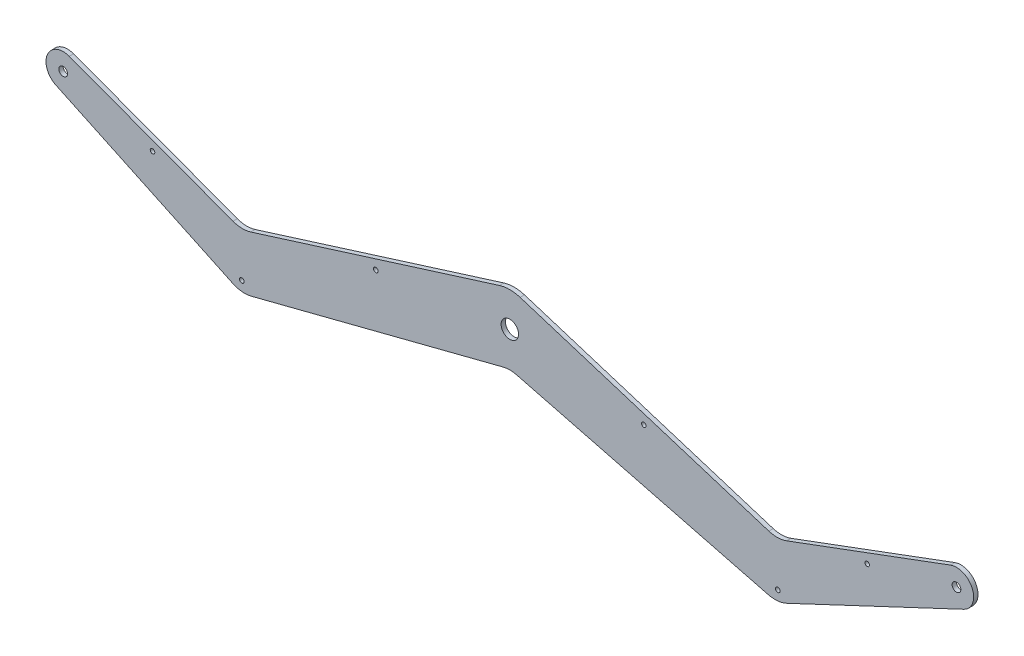
ISO-10303-21;
HEADER;
FILE_DESCRIPTION(('STEP AP214'),'2;1');
FILE_NAME('part.step','',(''),(''),'','','');
FILE_SCHEMA(('AUTOMOTIVE_DESIGN { 1 0 10303 214 1 1 1 1 }'));
ENDSEC;
DATA;
#1=APPLICATION_CONTEXT('core data for automotive mechanical design processes');
#2=APPLICATION_PROTOCOL_DEFINITION('international standard','automotive_design',2000,#1);
#3=PRODUCT_CONTEXT('',#1,'mechanical');
#4=PRODUCT('Part','Part','',(#3));
#5=PRODUCT_RELATED_PRODUCT_CATEGORY('part','',(#4));
#6=PRODUCT_DEFINITION_FORMATION('','',#4);
#7=PRODUCT_DEFINITION_CONTEXT('part definition',#1,'design');
#8=PRODUCT_DEFINITION('design','',#6,#7);
#9=PRODUCT_DEFINITION_SHAPE('','',#8);
#10=(LENGTH_UNIT() NAMED_UNIT(*) SI_UNIT(.MILLI.,.METRE.));
#11=(NAMED_UNIT(*) PLANE_ANGLE_UNIT() SI_UNIT($,.RADIAN.));
#12=(NAMED_UNIT(*) SI_UNIT($,.STERADIAN.) SOLID_ANGLE_UNIT());
#13=UNCERTAINTY_MEASURE_WITH_UNIT(LENGTH_MEASURE(1.E-05),#10,'distance_accuracy_value','');
#14=(GEOMETRIC_REPRESENTATION_CONTEXT(3) GLOBAL_UNCERTAINTY_ASSIGNED_CONTEXT((#13)) GLOBAL_UNIT_ASSIGNED_CONTEXT((#10,
#11,#12)) REPRESENTATION_CONTEXT('',''));
#15=CARTESIAN_POINT('',(0.,0.,0.));
#16=DIRECTION('',(0.,0.,1.));
#17=DIRECTION('',(1.,0.,0.));
#18=AXIS2_PLACEMENT_3D('',#15,#16,#17);
#19=CARTESIAN_POINT('',(0.,0.,3.18));
#20=DIRECTION('',(0.,0.,-1.));
#21=DIRECTION('',(-1.,0.,0.));
#22=AXIS2_PLACEMENT_3D('',#19,#20,#21);
#23=CYLINDRICAL_SURFACE('',#22,25.);
#24=CARTESIAN_POINT('',(0.,0.,0.));
#25=DIRECTION('',(0.,0.,1.));
#26=DIRECTION('',(1.,0.,0.));
#27=AXIS2_PLACEMENT_3D('',#24,#25,#26);
#28=CIRCLE('',#27,25.);
#29=CARTESIAN_POINT('',(7.48639197609011,23.8527552953602,0.));
#30=VERTEX_POINT('',#29);
#31=CARTESIAN_POINT('',(-7.48639197609028,23.8527552953601,0.));
#32=VERTEX_POINT('',#31);
#33=EDGE_CURVE('E194',#30,#32,#28,.T.);
#34=ORIENTED_EDGE('',*,*,#33,.T.);
#35=DIRECTION('',(0.,0.,-1.));
#36=VECTOR('',#35,1.);
#37=CARTESIAN_POINT('',(-7.48639197609028,23.8527552953601,3.18));
#38=LINE('',#37,#36);
#39=CARTESIAN_POINT('',(-7.48639197609028,23.8527552953601,3.18));
#40=VERTEX_POINT('',#39);
#41=EDGE_CURVE('E11',#40,#32,#38,.T.);
#42=ORIENTED_EDGE('',*,*,#41,.F.);
#43=CARTESIAN_POINT('',(0.,0.,3.18));
#44=DIRECTION('',(0.,0.,1.));
#45=DIRECTION('',(1.,0.,0.));
#46=AXIS2_PLACEMENT_3D('',#43,#44,#45);
#47=CIRCLE('',#46,25.);
#48=CARTESIAN_POINT('',(7.48639197609011,23.8527552953602,3.18));
#49=VERTEX_POINT('',#48);
#50=EDGE_CURVE('E241',#49,#40,#47,.T.);
#51=ORIENTED_EDGE('',*,*,#50,.F.);
#52=DIRECTION('',(0.,0.,-1.));
#53=VECTOR('',#52,1.);
#54=CARTESIAN_POINT('',(7.48639197609011,23.8527552953602,3.18));
#55=LINE('',#54,#53);
#56=EDGE_CURVE('E190',#49,#30,#55,.T.);
#57=ORIENTED_EDGE('',*,*,#56,.T.);
#58=EDGE_LOOP('',(#34,#42,#51,#57));
#59=FACE_BOUND('',#58,.T.);
#60=ADVANCED_FACE('F45',(#59),#23,.T.);
#61=CARTESIAN_POINT('',(-7.48639197609028,23.8527552953601,3.18));
#62=DIRECTION('',(0.299455679043611,-0.954110211814405,0.));
#63=DIRECTION('',(0.954110211814406,0.299455679043611,0.));
#64=AXIS2_PLACEMENT_3D('',#61,#62,#63);
#65=PLANE('',#64);
#66=DIRECTION('',(-0.954110211814405,-0.299455679043611,0.));
#67=VECTOR('',#66,1.);
#68=CARTESIAN_POINT('',(-7.48639197609028,23.8527552953601,0.));
#69=LINE('',#68,#67);
#70=CARTESIAN_POINT('',(-188.462821249747,-32.9482503410548,0.));
#71=VERTEX_POINT('',#70);
#72=EDGE_CURVE('E198',#32,#71,#69,.T.);
#73=ORIENTED_EDGE('',*,*,#72,.T.);
#74=DIRECTION('',(0.,0.,-1.));
#75=VECTOR('',#74,1.);
#76=CARTESIAN_POINT('',(-188.462821249747,-32.9482503410548,3.18));
#77=LINE('',#76,#75);
#78=CARTESIAN_POINT('',(-188.462821249747,-32.9482503410548,3.18));
#79=VERTEX_POINT('',#78);
#80=EDGE_CURVE('E54',#79,#71,#77,.T.);
#81=ORIENTED_EDGE('',*,*,#80,.F.);
#82=DIRECTION('',(-0.954110211814405,-0.299455679043611,0.));
#83=VECTOR('',#82,1.);
#84=CARTESIAN_POINT('',(-7.48639197609028,23.8527552953601,3.18));
#85=LINE('',#84,#83);
#86=EDGE_CURVE('E129',#40,#79,#85,.T.);
#87=ORIENTED_EDGE('',*,*,#86,.F.);
#88=ORIENTED_EDGE('',*,*,#41,.T.);
#89=EDGE_LOOP('',(#73,#81,#87,#88));
#90=FACE_BOUND('',#89,.T.);
#91=ADVANCED_FACE('F364',(#90),#65,.F.);
#92=CARTESIAN_POINT('',(-194.45193483062,-13.8660461047667,3.18));
#93=DIRECTION('',(0.,0.,-1.));
#94=DIRECTION('',(-1.,0.,0.));
#95=AXIS2_PLACEMENT_3D('',#92,#93,#94);
#96=CYLINDRICAL_SURFACE('',#95,20.);
#97=CARTESIAN_POINT('',(-194.45193483062,-13.8660461047667,0.));
#98=DIRECTION('',(0.,0.,-1.));
#99=DIRECTION('',(-1.,0.,0.));
#100=AXIS2_PLACEMENT_3D('',#97,#98,#99);
#101=CIRCLE('',#100,20.);
#102=CARTESIAN_POINT('',(-201.42204773154,-32.6121797367566,0.));
#103=VERTEX_POINT('',#102);
#104=EDGE_CURVE('E202',#71,#103,#101,.T.);
#105=ORIENTED_EDGE('',*,*,#104,.T.);
#106=DIRECTION('',(0.,0.,-1.));
#107=VECTOR('',#106,1.);
#108=CARTESIAN_POINT('',(-201.42204773154,-32.6121797367566,3.18));
#109=LINE('',#108,#107);
#110=CARTESIAN_POINT('',(-201.42204773154,-32.6121797367566,3.18));
#111=VERTEX_POINT('',#110);
#112=EDGE_CURVE('E284',#111,#103,#109,.T.);
#113=ORIENTED_EDGE('',*,*,#112,.F.);
#114=CARTESIAN_POINT('',(-194.45193483062,-13.8660461047667,3.18));
#115=DIRECTION('',(0.,0.,-1.));
#116=DIRECTION('',(-1.,0.,0.));
#117=AXIS2_PLACEMENT_3D('',#114,#115,#116);
#118=CIRCLE('',#117,20.);
#119=EDGE_CURVE('E294',#79,#111,#118,.T.);
#120=ORIENTED_EDGE('',*,*,#119,.F.);
#121=ORIENTED_EDGE('',*,*,#80,.T.);
#122=EDGE_LOOP('',(#105,#113,#120,#121));
#123=FACE_BOUND('',#122,.T.);
#124=ADVANCED_FACE('F292',(#123),#96,.F.);
#125=CARTESIAN_POINT('',(-320.643679436925,11.7163335199937,3.18));
#126=DIRECTION('',(-0.348505645046018,-0.937306681599496,0.));
#127=DIRECTION('',(0.937306681599496,-0.348505645046018,0.));
#128=AXIS2_PLACEMENT_3D('',#125,#126,#127);
#129=PLANE('',#128);
#130=DIRECTION('',(-0.937306681599496,0.348505645046018,0.));
#131=VECTOR('',#130,1.);
#132=CARTESIAN_POINT('',(-320.643679436925,11.7163335199937,0.));
#133=LINE('',#132,#131);
#134=CARTESIAN_POINT('',(-320.643679436925,11.7163335199937,0.));
#135=VERTEX_POINT('',#134);
#136=EDGE_CURVE('E205',#103,#135,#133,.T.);
#137=ORIENTED_EDGE('',*,*,#136,.T.);
#138=DIRECTION('',(0.,0.,-1.));
#139=VECTOR('',#138,1.);
#140=CARTESIAN_POINT('',(-320.643679436925,11.7163335199937,3.18));
#141=LINE('',#140,#139);
#142=CARTESIAN_POINT('',(-320.643679436925,11.7163335199937,3.18));
#143=VERTEX_POINT('',#142);
#144=EDGE_CURVE('E280',#143,#135,#141,.T.);
#145=ORIENTED_EDGE('',*,*,#144,.F.);
#146=DIRECTION('',(-0.937306681599496,0.348505645046018,0.));
#147=VECTOR('',#146,1.);
#148=CARTESIAN_POINT('',(-320.643679436925,11.7163335199937,3.18));
#149=LINE('',#148,#147);
#150=EDGE_CURVE('E313',#111,#143,#149,.T.);
#151=ORIENTED_EDGE('',*,*,#150,.F.);
#152=ORIENTED_EDGE('',*,*,#112,.T.);
#153=EDGE_LOOP('',(#137,#145,#151,#152));
#154=FACE_BOUND('',#153,.T.);
#155=ADVANCED_FACE('F303',(#154),#129,.F.);
#156=CARTESIAN_POINT('',(-325.,0.,3.18));
#157=DIRECTION('',(0.,0.,-1.));
#158=DIRECTION('',(-1.,0.,0.));
#159=AXIS2_PLACEMENT_3D('',#156,#157,#158);
#160=CYLINDRICAL_SURFACE('',#159,12.5);
#161=CARTESIAN_POINT('',(-325.,0.,0.));
#162=DIRECTION('',(0.,0.,1.));
#163=DIRECTION('',(1.,0.,0.));
#164=AXIS2_PLACEMENT_3D('',#161,#162,#163);
#165=CIRCLE('',#164,12.5);
#166=CARTESIAN_POINT('',(-330.323051891432,-11.3099566118146,0.));
#167=VERTEX_POINT('',#166);
#168=EDGE_CURVE('E208',#135,#167,#165,.T.);
#169=ORIENTED_EDGE('',*,*,#168,.T.);
#170=DIRECTION('',(0.,0.,-1.));
#171=VECTOR('',#170,1.);
#172=CARTESIAN_POINT('',(-330.323051891432,-11.3099566118146,3.18));
#173=LINE('',#172,#171);
#174=CARTESIAN_POINT('',(-330.323051891432,-11.3099566118146,3.18));
#175=VERTEX_POINT('',#174);
#176=EDGE_CURVE('E276',#175,#167,#173,.T.);
#177=ORIENTED_EDGE('',*,*,#176,.F.);
#178=CARTESIAN_POINT('',(-325.,0.,3.18));
#179=DIRECTION('',(0.,0.,1.));
#180=DIRECTION('',(1.,0.,0.));
#181=AXIS2_PLACEMENT_3D('',#178,#179,#180);
#182=CIRCLE('',#181,12.5);
#183=EDGE_CURVE('E309',#143,#175,#182,.T.);
#184=ORIENTED_EDGE('',*,*,#183,.F.);
#185=ORIENTED_EDGE('',*,*,#144,.T.);
#186=EDGE_LOOP('',(#169,#177,#184,#185));
#187=FACE_BOUND('',#186,.T.);
#188=ADVANCED_FACE('F307',(#187),#160,.T.);
#189=CARTESIAN_POINT('',(-330.323051891432,-11.3099566118146,3.18));
#190=DIRECTION('',(0.425844151314518,0.904796528945165,0.));
#191=DIRECTION('',(-0.904796528945165,0.425844151314518,0.));
#192=AXIS2_PLACEMENT_3D('',#189,#190,#191);
#193=PLANE('',#192);
#194=DIRECTION('',(0.904796528945165,-0.425844151314518,0.));
#195=VECTOR('',#194,1.);
#196=CARTESIAN_POINT('',(-330.323051891432,-11.3099566118146,0.));
#197=LINE('',#196,#195);
#198=CARTESIAN_POINT('',(-201.512349728986,-71.9349506163152,0.));
#199=VERTEX_POINT('',#198);
#200=EDGE_CURVE('E211',#167,#199,#197,.T.);
#201=ORIENTED_EDGE('',*,*,#200,.T.);
#202=DIRECTION('',(0.,0.,-1.));
#203=VECTOR('',#202,1.);
#204=CARTESIAN_POINT('',(-201.512349728986,-71.9349506163152,3.18));
#205=LINE('',#204,#203);
#206=CARTESIAN_POINT('',(-201.512349728986,-71.9349506163152,3.18));
#207=VERTEX_POINT('',#206);
#208=EDGE_CURVE('E272',#207,#199,#205,.T.);
#209=ORIENTED_EDGE('',*,*,#208,.F.);
#210=DIRECTION('',(0.904796528945165,-0.425844151314518,0.));
#211=VECTOR('',#210,1.);
#212=CARTESIAN_POINT('',(-330.323051891432,-11.3099566118146,3.18));
#213=LINE('',#212,#211);
#214=EDGE_CURVE('E312',#175,#207,#213,.T.);
#215=ORIENTED_EDGE('',*,*,#214,.F.);
#216=ORIENTED_EDGE('',*,*,#176,.T.);
#217=EDGE_LOOP('',(#201,#209,#215,#216));
#218=FACE_BOUND('',#217,.T.);
#219=ADVANCED_FACE('F377',(#218),#193,.F.);
#220=CARTESIAN_POINT('',(-192.995466702696,-53.8390200374119,3.18));
#221=DIRECTION('',(0.,0.,-1.));
#222=DIRECTION('',(-1.,0.,0.));
#223=AXIS2_PLACEMENT_3D('',#220,#221,#222);
#224=CYLINDRICAL_SURFACE('',#223,20.);
#225=CARTESIAN_POINT('',(-192.995466702696,-53.8390200374119,0.));
#226=DIRECTION('',(0.,0.,1.));
#227=DIRECTION('',(-1.,0.,0.));
#228=AXIS2_PLACEMENT_3D('',#225,#226,#227);
#229=CIRCLE('',#228,20.);
#230=CARTESIAN_POINT('',(-188.027959697342,-73.2122973582928,0.));
#231=VERTEX_POINT('',#230);
#232=EDGE_CURVE('E214',#199,#231,#229,.T.);
#233=ORIENTED_EDGE('',*,*,#232,.T.);
#234=DIRECTION('',(0.,0.,-1.));
#235=VECTOR('',#234,1.);
#236=CARTESIAN_POINT('',(-188.027959697342,-73.2122973582928,3.18));
#237=LINE('',#236,#235);
#238=CARTESIAN_POINT('',(-188.027959697342,-73.2122973582928,3.18));
#239=VERTEX_POINT('',#238);
#240=EDGE_CURVE('E268',#239,#231,#237,.T.);
#241=ORIENTED_EDGE('',*,*,#240,.F.);
#242=CARTESIAN_POINT('',(-192.995466702696,-53.8390200374119,3.18));
#243=DIRECTION('',(0.,0.,1.));
#244=DIRECTION('',(-1.,0.,0.));
#245=AXIS2_PLACEMENT_3D('',#242,#243,#244);
#246=CIRCLE('',#245,20.);
#247=EDGE_CURVE('E317',#207,#239,#246,.T.);
#248=ORIENTED_EDGE('',*,*,#247,.F.);
#249=ORIENTED_EDGE('',*,*,#208,.T.);
#250=EDGE_LOOP('',(#233,#241,#248,#249));
#251=FACE_BOUND('',#250,.T.);
#252=ADVANCED_FACE('F380',(#251),#224,.T.);
#253=CARTESIAN_POINT('',(-4.96750700535415,-26.2737197449626,3.18));
#254=DIRECTION('',(-0.248375350267704,0.968663866044045,0.));
#255=DIRECTION('',(-0.968663866044045,-0.248375350267704,0.));
#256=AXIS2_PLACEMENT_3D('',#253,#254,#255);
#257=PLANE('',#256);
#258=DIRECTION('',(0.968663866044045,0.248375350267704,0.));
#259=VECTOR('',#258,1.);
#260=CARTESIAN_POINT('',(-4.96750700535415,-26.2737197449626,0.));
#261=LINE('',#260,#259);
#262=CARTESIAN_POINT('',(-4.96750700535415,-26.2737197449626,0.));
#263=VERTEX_POINT('',#262);
#264=EDGE_CURVE('E217',#231,#263,#261,.T.);
#265=ORIENTED_EDGE('',*,*,#264,.T.);
#266=DIRECTION('',(0.,0.,-1.));
#267=VECTOR('',#266,1.);
#268=CARTESIAN_POINT('',(-4.96750700535415,-26.2737197449626,3.18));
#269=LINE('',#268,#267);
#270=CARTESIAN_POINT('',(-4.96750700535415,-26.2737197449626,3.18));
#271=VERTEX_POINT('',#270);
#272=EDGE_CURVE('E264',#271,#263,#269,.T.);
#273=ORIENTED_EDGE('',*,*,#272,.F.);
#274=DIRECTION('',(0.968663866044045,0.248375350267704,0.));
#275=VECTOR('',#274,1.);
#276=CARTESIAN_POINT('',(-4.96750700535415,-26.2737197449626,3.18));
#277=LINE('',#276,#275);
#278=EDGE_CURVE('E324',#239,#271,#277,.T.);
#279=ORIENTED_EDGE('',*,*,#278,.F.);
#280=ORIENTED_EDGE('',*,*,#240,.T.);
#281=EDGE_LOOP('',(#265,#273,#279,#280));
#282=FACE_BOUND('',#281,.T.);
#283=ADVANCED_FACE('F384',(#282),#257,.F.);
#284=CARTESIAN_POINT('',(0.,-45.6469970658435,3.18));
#285=DIRECTION('',(0.,0.,-1.));
#286=DIRECTION('',(-1.,0.,0.));
#287=AXIS2_PLACEMENT_3D('',#284,#285,#286);
#288=CYLINDRICAL_SURFACE('',#287,20.);
#289=CARTESIAN_POINT('',(0.,-45.6469970658435,0.));
#290=DIRECTION('',(0.,0.,-1.));
#291=DIRECTION('',(-1.,0.,0.));
#292=AXIS2_PLACEMENT_3D('',#289,#290,#291);
#293=CIRCLE('',#292,20.);
#294=CARTESIAN_POINT('',(4.96750700535415,-26.2737197449626,0.));
#295=VERTEX_POINT('',#294);
#296=EDGE_CURVE('E220',#263,#295,#293,.T.);
#297=ORIENTED_EDGE('',*,*,#296,.T.);
#298=DIRECTION('',(0.,0.,-1.));
#299=VECTOR('',#298,1.);
#300=CARTESIAN_POINT('',(4.96750700535415,-26.2737197449626,3.18));
#301=LINE('',#300,#299);
#302=CARTESIAN_POINT('',(4.96750700535415,-26.2737197449626,3.18));
#303=VERTEX_POINT('',#302);
#304=EDGE_CURVE('E260',#303,#295,#301,.T.);
#305=ORIENTED_EDGE('',*,*,#304,.F.);
#306=CARTESIAN_POINT('',(0.,-45.6469970658435,3.18));
#307=DIRECTION('',(0.,0.,-1.));
#308=DIRECTION('',(-1.,0.,0.));
#309=AXIS2_PLACEMENT_3D('',#306,#307,#308);
#310=CIRCLE('',#309,20.);
#311=EDGE_CURVE('E327',#271,#303,#310,.T.);
#312=ORIENTED_EDGE('',*,*,#311,.F.);
#313=ORIENTED_EDGE('',*,*,#272,.T.);
#314=EDGE_LOOP('',(#297,#305,#312,#313));
#315=FACE_BOUND('',#314,.T.);
#316=ADVANCED_FACE('F388',(#315),#288,.F.);
#317=CARTESIAN_POINT('',(4.96750700535415,-26.2737197449626,3.18));
#318=DIRECTION('',(0.248375350267704,0.968663866044045,0.));
#319=DIRECTION('',(-0.968663866044045,0.248375350267704,0.));
#320=AXIS2_PLACEMENT_3D('',#317,#318,#319);
#321=PLANE('',#320);
#322=DIRECTION('',(0.968663866044045,-0.248375350267704,0.));
#323=VECTOR('',#322,1.);
#324=CARTESIAN_POINT('',(4.96750700535415,-26.2737197449626,0.));
#325=LINE('',#324,#323);
#326=CARTESIAN_POINT('',(188.027959697342,-73.2122973582928,0.));
#327=VERTEX_POINT('',#326);
#328=EDGE_CURVE('E223',#295,#327,#325,.T.);
#329=ORIENTED_EDGE('',*,*,#328,.T.);
#330=DIRECTION('',(0.,0.,-1.));
#331=VECTOR('',#330,1.);
#332=CARTESIAN_POINT('',(188.027959697342,-73.2122973582928,3.18));
#333=LINE('',#332,#331);
#334=CARTESIAN_POINT('',(188.027959697342,-73.2122973582928,3.18));
#335=VERTEX_POINT('',#334);
#336=EDGE_CURVE('E256',#335,#327,#333,.T.);
#337=ORIENTED_EDGE('',*,*,#336,.F.);
#338=DIRECTION('',(0.968663866044045,-0.248375350267704,0.));
#339=VECTOR('',#338,1.);
#340=CARTESIAN_POINT('',(4.96750700535415,-26.2737197449626,3.18));
#341=LINE('',#340,#339);
#342=EDGE_CURVE('E330',#303,#335,#341,.T.);
#343=ORIENTED_EDGE('',*,*,#342,.F.);
#344=ORIENTED_EDGE('',*,*,#304,.T.);
#345=EDGE_LOOP('',(#329,#337,#343,#344));
#346=FACE_BOUND('',#345,.T.);
#347=ADVANCED_FACE('F392',(#346),#321,.F.);
#348=CARTESIAN_POINT('',(192.995466702696,-53.8390200374112,3.18));
#349=DIRECTION('',(0.,0.,-1.));
#350=DIRECTION('',(-1.,0.,0.));
#351=AXIS2_PLACEMENT_3D('',#348,#349,#350);
#352=CYLINDRICAL_SURFACE('',#351,20.0000000000003);
#353=CARTESIAN_POINT('',(192.995466702696,-53.8390200374112,0.));
#354=DIRECTION('',(0.,0.,1.));
#355=DIRECTION('',(1.,0.,0.));
#356=AXIS2_PLACEMENT_3D('',#353,#354,#355);
#357=CIRCLE('',#356,20.0000000000003);
#358=CARTESIAN_POINT('',(201.512349728987,-71.9349506163148,0.));
#359=VERTEX_POINT('',#358);
#360=EDGE_CURVE('E226',#327,#359,#357,.T.);
#361=ORIENTED_EDGE('',*,*,#360,.T.);
#362=DIRECTION('',(0.,0.,-1.));
#363=VECTOR('',#362,1.);
#364=CARTESIAN_POINT('',(201.512349728987,-71.9349506163148,3.18));
#365=LINE('',#364,#363);
#366=CARTESIAN_POINT('',(201.512349728987,-71.9349506163148,3.18));
#367=VERTEX_POINT('',#366);
#368=EDGE_CURVE('E252',#367,#359,#365,.T.);
#369=ORIENTED_EDGE('',*,*,#368,.F.);
#370=CARTESIAN_POINT('',(192.995466702696,-53.8390200374112,3.18));
#371=DIRECTION('',(0.,0.,1.));
#372=DIRECTION('',(1.,0.,0.));
#373=AXIS2_PLACEMENT_3D('',#370,#371,#372);
#374=CIRCLE('',#373,20.0000000000003);
#375=EDGE_CURVE('E333',#335,#367,#374,.T.);
#376=ORIENTED_EDGE('',*,*,#375,.F.);
#377=ORIENTED_EDGE('',*,*,#336,.T.);
#378=EDGE_LOOP('',(#361,#369,#376,#377));
#379=FACE_BOUND('',#378,.T.);
#380=ADVANCED_FACE('F396',(#379),#352,.T.);
#381=CARTESIAN_POINT('',(330.323051891432,-11.3099566118134,3.18));
#382=DIRECTION('',(-0.425844151314521,0.904796528945163,0.));
#383=DIRECTION('',(-0.904796528945163,-0.425844151314521,0.));
#384=AXIS2_PLACEMENT_3D('',#381,#382,#383);
#385=PLANE('',#384);
#386=DIRECTION('',(0.904796528945163,0.425844151314521,0.));
#387=VECTOR('',#386,1.);
#388=CARTESIAN_POINT('',(330.323051891432,-11.3099566118134,0.));
#389=LINE('',#388,#387);
#390=CARTESIAN_POINT('',(330.323051891432,-11.3099566118134,0.));
#391=VERTEX_POINT('',#390);
#392=EDGE_CURVE('E229',#359,#391,#389,.T.);
#393=ORIENTED_EDGE('',*,*,#392,.T.);
#394=DIRECTION('',(0.,0.,-1.));
#395=VECTOR('',#394,1.);
#396=CARTESIAN_POINT('',(330.323051891432,-11.3099566118134,3.18));
#397=LINE('',#396,#395);
#398=CARTESIAN_POINT('',(330.323051891432,-11.3099566118134,3.18));
#399=VERTEX_POINT('',#398);
#400=EDGE_CURVE('E248',#399,#391,#397,.T.);
#401=ORIENTED_EDGE('',*,*,#400,.F.);
#402=DIRECTION('',(0.904796528945163,0.425844151314521,0.));
#403=VECTOR('',#402,1.);
#404=CARTESIAN_POINT('',(330.323051891432,-11.3099566118134,3.18));
#405=LINE('',#404,#403);
#406=EDGE_CURVE('E336',#367,#399,#405,.T.);
#407=ORIENTED_EDGE('',*,*,#406,.F.);
#408=ORIENTED_EDGE('',*,*,#368,.T.);
#409=EDGE_LOOP('',(#393,#401,#407,#408));
#410=FACE_BOUND('',#409,.T.);
#411=ADVANCED_FACE('F344',(#410),#385,.F.);
#412=CARTESIAN_POINT('',(325.,1.13797860024079E-12,3.18));
#413=DIRECTION('',(0.,0.,-1.));
#414=DIRECTION('',(-1.,0.,0.));
#415=AXIS2_PLACEMENT_3D('',#412,#413,#414);
#416=CYLINDRICAL_SURFACE('',#415,12.5);
#417=CARTESIAN_POINT('',(325.,1.13797860024079E-12,0.));
#418=DIRECTION('',(0.,0.,1.));
#419=DIRECTION('',(-1.,0.,0.));
#420=AXIS2_PLACEMENT_3D('',#417,#418,#419);
#421=CIRCLE('',#420,12.5);
#422=CARTESIAN_POINT('',(320.643679436925,11.7163335199949,0.));
#423=VERTEX_POINT('',#422);
#424=EDGE_CURVE('E232',#391,#423,#421,.T.);
#425=ORIENTED_EDGE('',*,*,#424,.T.);
#426=DIRECTION('',(0.,0.,-1.));
#427=VECTOR('',#426,1.);
#428=CARTESIAN_POINT('',(320.643679436925,11.7163335199949,3.18));
#429=LINE('',#428,#427);
#430=CARTESIAN_POINT('',(320.643679436925,11.7163335199949,3.18));
#431=VERTEX_POINT('',#430);
#432=EDGE_CURVE('E183',#431,#423,#429,.T.);
#433=ORIENTED_EDGE('',*,*,#432,.F.);
#434=CARTESIAN_POINT('',(325.,1.13797860024079E-12,3.18));
#435=DIRECTION('',(0.,0.,1.));
#436=DIRECTION('',(-1.,0.,0.));
#437=AXIS2_PLACEMENT_3D('',#434,#435,#436);
#438=CIRCLE('',#437,12.5);
#439=EDGE_CURVE('E172',#399,#431,#438,.T.);
#440=ORIENTED_EDGE('',*,*,#439,.F.);
#441=ORIENTED_EDGE('',*,*,#400,.T.);
#442=EDGE_LOOP('',(#425,#433,#440,#441));
#443=FACE_BOUND('',#442,.T.);
#444=ADVANCED_FACE('F348',(#443),#416,.T.);
#445=CARTESIAN_POINT('',(320.643679436925,11.7163335199948,3.18));
#446=DIRECTION('',(0.348505645046021,-0.937306681599495,0.));
#447=DIRECTION('',(0.937306681599495,0.348505645046022,0.));
#448=AXIS2_PLACEMENT_3D('',#445,#446,#447);
#449=PLANE('',#448);
#450=DIRECTION('',(-0.937306681599495,-0.348505645046022,0.));
#451=VECTOR('',#450,1.);
#452=CARTESIAN_POINT('',(320.643679436925,11.7163335199948,0.));
#453=LINE('',#452,#451);
#454=CARTESIAN_POINT('',(201.42204773154,-32.6121797367559,0.));
#455=VERTEX_POINT('',#454);
#456=EDGE_CURVE('E181',#423,#455,#453,.T.);
#457=ORIENTED_EDGE('',*,*,#456,.T.);
#458=DIRECTION('',(0.,0.,-1.));
#459=VECTOR('',#458,1.);
#460=CARTESIAN_POINT('',(201.42204773154,-32.6121797367559,3.18));
#461=LINE('',#460,#459);
#462=CARTESIAN_POINT('',(201.42204773154,-32.6121797367559,3.18));
#463=VERTEX_POINT('',#462);
#464=EDGE_CURVE('E178',#463,#455,#461,.T.);
#465=ORIENTED_EDGE('',*,*,#464,.F.);
#466=DIRECTION('',(-0.937306681599495,-0.348505645046022,0.));
#467=VECTOR('',#466,1.);
#468=CARTESIAN_POINT('',(320.643679436925,11.7163335199948,3.18));
#469=LINE('',#468,#467);
#470=EDGE_CURVE('E166',#431,#463,#469,.T.);
#471=ORIENTED_EDGE('',*,*,#470,.F.);
#472=ORIENTED_EDGE('',*,*,#432,.T.);
#473=EDGE_LOOP('',(#457,#465,#471,#472));
#474=FACE_BOUND('',#473,.T.);
#475=ADVANCED_FACE('F179',(#474),#449,.F.);
#476=CARTESIAN_POINT('',(194.45193483062,-13.866046104766,3.18));
#477=DIRECTION('',(0.,0.,-1.));
#478=DIRECTION('',(-1.,0.,0.));
#479=AXIS2_PLACEMENT_3D('',#476,#477,#478);
#480=CYLINDRICAL_SURFACE('',#479,20.);
#481=CARTESIAN_POINT('',(194.45193483062,-13.866046104766,0.));
#482=DIRECTION('',(0.,0.,-1.));
#483=DIRECTION('',(1.,0.,0.));
#484=AXIS2_PLACEMENT_3D('',#481,#482,#483);
#485=CIRCLE('',#484,20.);
#486=CARTESIAN_POINT('',(188.462821249747,-32.9482503410541,0.));
#487=VERTEX_POINT('',#486);
#488=EDGE_CURVE('E115',#455,#487,#485,.T.);
#489=ORIENTED_EDGE('',*,*,#488,.T.);
#490=DIRECTION('',(0.,0.,-1.));
#491=VECTOR('',#490,1.);
#492=CARTESIAN_POINT('',(188.462821249747,-32.9482503410541,3.18));
#493=LINE('',#492,#491);
#494=CARTESIAN_POINT('',(188.462821249747,-32.9482503410541,3.18));
#495=VERTEX_POINT('',#494);
#496=EDGE_CURVE('E184',#495,#487,#493,.T.);
#497=ORIENTED_EDGE('',*,*,#496,.F.);
#498=CARTESIAN_POINT('',(194.45193483062,-13.866046104766,3.18));
#499=DIRECTION('',(0.,0.,-1.));
#500=DIRECTION('',(1.,0.,0.));
#501=AXIS2_PLACEMENT_3D('',#498,#499,#500);
#502=CIRCLE('',#501,20.);
#503=EDGE_CURVE('E170',#463,#495,#502,.T.);
#504=ORIENTED_EDGE('',*,*,#503,.F.);
#505=ORIENTED_EDGE('',*,*,#464,.T.);
#506=EDGE_LOOP('',(#489,#497,#504,#505));
#507=FACE_BOUND('',#506,.T.);
#508=ADVANCED_FACE('F186',(#507),#480,.F.);
#509=CARTESIAN_POINT('',(7.48639197609011,23.8527552953602,3.18));
#510=DIRECTION('',(-0.299455679043608,-0.954110211814407,0.));
#511=DIRECTION('',(0.954110211814407,-0.299455679043608,0.));
#512=AXIS2_PLACEMENT_3D('',#509,#510,#511);
#513=PLANE('',#512);
#514=DIRECTION('',(-0.954110211814406,0.299455679043608,0.));
#515=VECTOR('',#514,1.);
#516=CARTESIAN_POINT('',(7.48639197609011,23.8527552953602,0.));
#517=LINE('',#516,#515);
#518=EDGE_CURVE('E121',#487,#30,#517,.T.);
#519=ORIENTED_EDGE('',*,*,#518,.T.);
#520=ORIENTED_EDGE('',*,*,#56,.F.);
#521=DIRECTION('',(-0.954110211814406,0.299455679043608,0.));
#522=VECTOR('',#521,1.);
#523=CARTESIAN_POINT('',(7.48639197609011,23.8527552953602,3.18));
#524=LINE('',#523,#522);
#525=EDGE_CURVE('E62',#495,#49,#524,.T.);
#526=ORIENTED_EDGE('',*,*,#525,.F.);
#527=ORIENTED_EDGE('',*,*,#496,.T.);
#528=EDGE_LOOP('',(#519,#520,#526,#527));
#529=FACE_BOUND('',#528,.T.);
#530=ADVANCED_FACE('F352',(#529),#513,.F.);
#531=CARTESIAN_POINT('',(0.,0.,3.18));
#532=DIRECTION('',(0.,0.,1.));
#533=DIRECTION('',(1.,0.,0.));
#534=AXIS2_PLACEMENT_3D('',#531,#532,#533);
#535=PLANE('',#534);
#536=CARTESIAN_POINT('',(325.,1.07552855510562E-12,3.18));
#537=DIRECTION('',(0.,0.,1.));
#538=DIRECTION('',(-1.,0.,0.));
#539=AXIS2_PLACEMENT_3D('',#536,#537,#538);
#540=CIRCLE('',#539,3.17499999999997);
#541=CARTESIAN_POINT('',(321.825,1.07552855510562E-12,3.18));
#542=VERTEX_POINT('',#541);
#543=EDGE_CURVE('E533',#542,#542,#540,.T.);
#544=ORIENTED_EDGE('',*,*,#543,.F.);
#545=EDGE_LOOP('',(#544));
#546=FACE_BOUND('',#545,.T.);
#547=CARTESIAN_POINT('',(260.,-17.8319583411755,3.18));
#548=DIRECTION('',(0.,0.,1.));
#549=DIRECTION('',(-1.,0.,0.));
#550=AXIS2_PLACEMENT_3D('',#547,#548,#549);
#551=CIRCLE('',#550,1.64999999999999);
#552=CARTESIAN_POINT('',(258.35,-17.8319583411755,3.18));
#553=VERTEX_POINT('',#552);
#554=EDGE_CURVE('E540',#553,#553,#551,.T.);
#555=ORIENTED_EDGE('',*,*,#554,.F.);
#556=EDGE_LOOP('',(#555));
#557=FACE_BOUND('',#556,.T.);
#558=CARTESIAN_POINT('',(195.,-66.7383126444369,3.18));
#559=DIRECTION('',(0.,0.,1.));
#560=DIRECTION('',(-1.,0.,0.));
#561=AXIS2_PLACEMENT_3D('',#558,#559,#560);
#562=CIRCLE('',#561,1.65000000000002);
#563=CARTESIAN_POINT('',(193.35,-66.7383126444369,3.18));
#564=VERTEX_POINT('',#563);
#565=EDGE_CURVE('E596',#564,#564,#562,.T.);
#566=ORIENTED_EDGE('',*,*,#565,.F.);
#567=EDGE_LOOP('',(#566));
#568=FACE_BOUND('',#567,.T.);
#569=CARTESIAN_POINT('',(97.5,-11.3987881638652,3.18));
#570=DIRECTION('',(0.,0.,1.));
#571=DIRECTION('',(-1.,0.,0.));
#572=AXIS2_PLACEMENT_3D('',#569,#570,#571);
#573=CIRCLE('',#572,1.65);
#574=CARTESIAN_POINT('',(95.85,-11.3987881638652,3.18));
#575=VERTEX_POINT('',#574);
#576=EDGE_CURVE('E588',#575,#575,#573,.T.);
#577=ORIENTED_EDGE('',*,*,#576,.F.);
#578=EDGE_LOOP('',(#577));
#579=FACE_BOUND('',#578,.T.);
#580=CARTESIAN_POINT('',(-260.,-17.8319583411755,3.18));
#581=DIRECTION('',(0.,0.,1.));
#582=DIRECTION('',(1.,0.,0.));
#583=AXIS2_PLACEMENT_3D('',#580,#581,#582);
#584=CIRCLE('',#583,1.64999999999999);
#585=CARTESIAN_POINT('',(-258.35,-17.8319583411755,3.18));
#586=VERTEX_POINT('',#585);
#587=EDGE_CURVE('E580',#586,#586,#584,.T.);
#588=ORIENTED_EDGE('',*,*,#587,.F.);
#589=EDGE_LOOP('',(#588));
#590=FACE_BOUND('',#589,.T.);
#591=CARTESIAN_POINT('',(-195.,-66.7383126444369,3.18));
#592=DIRECTION('',(0.,0.,1.));
#593=DIRECTION('',(1.,0.,0.));
#594=AXIS2_PLACEMENT_3D('',#591,#592,#593);
#595=CIRCLE('',#594,1.65000000000002);
#596=CARTESIAN_POINT('',(-193.35,-66.7383126444369,3.18));
#597=VERTEX_POINT('',#596);
#598=EDGE_CURVE('E572',#597,#597,#595,.T.);
#599=ORIENTED_EDGE('',*,*,#598,.F.);
#600=EDGE_LOOP('',(#599));
#601=FACE_BOUND('',#600,.T.);
#602=CARTESIAN_POINT('',(-97.5,-11.3987881638652,3.18));
#603=DIRECTION('',(0.,0.,1.));
#604=DIRECTION('',(1.,0.,0.));
#605=AXIS2_PLACEMENT_3D('',#602,#603,#604);
#606=CIRCLE('',#605,1.65);
#607=CARTESIAN_POINT('',(-95.85,-11.3987881638652,3.18));
#608=VERTEX_POINT('',#607);
#609=EDGE_CURVE('E564',#608,#608,#606,.T.);
#610=ORIENTED_EDGE('',*,*,#609,.F.);
#611=EDGE_LOOP('',(#610));
#612=FACE_BOUND('',#611,.T.);
#613=CARTESIAN_POINT('',(-325.,0.,3.18));
#614=DIRECTION('',(0.,0.,1.));
#615=DIRECTION('',(1.,0.,0.));
#616=AXIS2_PLACEMENT_3D('',#613,#614,#615);
#617=CIRCLE('',#616,3.17499999999997);
#618=CARTESIAN_POINT('',(-321.825,0.,3.18));
#619=VERTEX_POINT('',#618);
#620=EDGE_CURVE('E552',#619,#619,#617,.T.);
#621=ORIENTED_EDGE('',*,*,#620,.F.);
#622=EDGE_LOOP('',(#621));
#623=FACE_BOUND('',#622,.T.);
#624=CARTESIAN_POINT('',(0.,0.,3.18));
#625=DIRECTION('',(0.,0.,1.));
#626=DIRECTION('',(1.,0.,0.));
#627=AXIS2_PLACEMENT_3D('',#624,#625,#626);
#628=CIRCLE('',#627,6.35);
#629=CARTESIAN_POINT('',(6.35,0.,3.18));
#630=VERTEX_POINT('',#629);
#631=EDGE_CURVE('E548',#630,#630,#628,.T.);
#632=ORIENTED_EDGE('',*,*,#631,.F.);
#633=EDGE_LOOP('',(#632));
#634=FACE_BOUND('',#633,.T.);
#635=ORIENTED_EDGE('',*,*,#50,.T.);
#636=ORIENTED_EDGE('',*,*,#86,.T.);
#637=ORIENTED_EDGE('',*,*,#119,.T.);
#638=ORIENTED_EDGE('',*,*,#150,.T.);
#639=ORIENTED_EDGE('',*,*,#183,.T.);
#640=ORIENTED_EDGE('',*,*,#214,.T.);
#641=ORIENTED_EDGE('',*,*,#247,.T.);
#642=ORIENTED_EDGE('',*,*,#278,.T.);
#643=ORIENTED_EDGE('',*,*,#311,.T.);
#644=ORIENTED_EDGE('',*,*,#342,.T.);
#645=ORIENTED_EDGE('',*,*,#375,.T.);
#646=ORIENTED_EDGE('',*,*,#406,.T.);
#647=ORIENTED_EDGE('',*,*,#439,.T.);
#648=ORIENTED_EDGE('',*,*,#470,.T.);
#649=ORIENTED_EDGE('',*,*,#503,.T.);
#650=ORIENTED_EDGE('',*,*,#525,.T.);
#651=EDGE_LOOP('',(#635,#636,#637,#638,#639,#640,#641,#642,#643,#644,#645,#646,#647,#648,#649,#650));
#652=FACE_BOUND('',#651,.T.);
#653=ADVANCED_FACE('F168',(#546,#557,#568,#579,#590,#601,#612,#623,#634,#652),#535,.T.);
#654=CARTESIAN_POINT('',(0.,0.,0.));
#655=DIRECTION('',(0.,0.,1.));
#656=DIRECTION('',(1.,0.,0.));
#657=AXIS2_PLACEMENT_3D('',#654,#655,#656);
#658=PLANE('',#657);
#659=CARTESIAN_POINT('',(325.,1.07552855510562E-12,0.));
#660=DIRECTION('',(0.,0.,1.));
#661=DIRECTION('',(-1.,0.,0.));
#662=AXIS2_PLACEMENT_3D('',#659,#660,#661);
#663=CIRCLE('',#662,3.17499999999997);
#664=CARTESIAN_POINT('',(321.825,1.07552855510562E-12,0.));
#665=VERTEX_POINT('',#664);
#666=EDGE_CURVE('E530',#665,#665,#663,.T.);
#667=ORIENTED_EDGE('',*,*,#666,.T.);
#668=EDGE_LOOP('',(#667));
#669=FACE_BOUND('',#668,.T.);
#670=CARTESIAN_POINT('',(260.,-17.8319583411755,0.));
#671=DIRECTION('',(0.,0.,1.));
#672=DIRECTION('',(-1.,0.,0.));
#673=AXIS2_PLACEMENT_3D('',#670,#671,#672);
#674=CIRCLE('',#673,1.64999999999999);
#675=CARTESIAN_POINT('',(258.35,-17.8319583411755,0.));
#676=VERTEX_POINT('',#675);
#677=EDGE_CURVE('E535',#676,#676,#674,.T.);
#678=ORIENTED_EDGE('',*,*,#677,.T.);
#679=EDGE_LOOP('',(#678));
#680=FACE_BOUND('',#679,.T.);
#681=CARTESIAN_POINT('',(195.,-66.7383126444369,0.));
#682=DIRECTION('',(0.,0.,1.));
#683=DIRECTION('',(-1.,0.,0.));
#684=AXIS2_PLACEMENT_3D('',#681,#682,#683);
#685=CIRCLE('',#684,1.65000000000002);
#686=CARTESIAN_POINT('',(193.35,-66.7383126444369,0.));
#687=VERTEX_POINT('',#686);
#688=EDGE_CURVE('E600',#687,#687,#685,.T.);
#689=ORIENTED_EDGE('',*,*,#688,.T.);
#690=EDGE_LOOP('',(#689));
#691=FACE_BOUND('',#690,.T.);
#692=CARTESIAN_POINT('',(97.5,-11.3987881638652,0.));
#693=DIRECTION('',(0.,0.,1.));
#694=DIRECTION('',(-1.,0.,0.));
#695=AXIS2_PLACEMENT_3D('',#692,#693,#694);
#696=CIRCLE('',#695,1.65);
#697=CARTESIAN_POINT('',(95.85,-11.3987881638652,0.));
#698=VERTEX_POINT('',#697);
#699=EDGE_CURVE('E592',#698,#698,#696,.T.);
#700=ORIENTED_EDGE('',*,*,#699,.T.);
#701=EDGE_LOOP('',(#700));
#702=FACE_BOUND('',#701,.T.);
#703=CARTESIAN_POINT('',(-260.,-17.8319583411755,0.));
#704=DIRECTION('',(0.,0.,1.));
#705=DIRECTION('',(1.,0.,0.));
#706=AXIS2_PLACEMENT_3D('',#703,#704,#705);
#707=CIRCLE('',#706,1.64999999999999);
#708=CARTESIAN_POINT('',(-258.35,-17.8319583411755,0.));
#709=VERTEX_POINT('',#708);
#710=EDGE_CURVE('E584',#709,#709,#707,.T.);
#711=ORIENTED_EDGE('',*,*,#710,.T.);
#712=EDGE_LOOP('',(#711));
#713=FACE_BOUND('',#712,.T.);
#714=CARTESIAN_POINT('',(-195.,-66.7383126444369,0.));
#715=DIRECTION('',(0.,0.,1.));
#716=DIRECTION('',(1.,0.,0.));
#717=AXIS2_PLACEMENT_3D('',#714,#715,#716);
#718=CIRCLE('',#717,1.65000000000002);
#719=CARTESIAN_POINT('',(-193.35,-66.7383126444369,0.));
#720=VERTEX_POINT('',#719);
#721=EDGE_CURVE('E576',#720,#720,#718,.T.);
#722=ORIENTED_EDGE('',*,*,#721,.T.);
#723=EDGE_LOOP('',(#722));
#724=FACE_BOUND('',#723,.T.);
#725=CARTESIAN_POINT('',(-97.5,-11.3987881638652,0.));
#726=DIRECTION('',(0.,0.,1.));
#727=DIRECTION('',(1.,0.,0.));
#728=AXIS2_PLACEMENT_3D('',#725,#726,#727);
#729=CIRCLE('',#728,1.65);
#730=CARTESIAN_POINT('',(-95.85,-11.3987881638652,0.));
#731=VERTEX_POINT('',#730);
#732=EDGE_CURVE('E568',#731,#731,#729,.T.);
#733=ORIENTED_EDGE('',*,*,#732,.T.);
#734=EDGE_LOOP('',(#733));
#735=FACE_BOUND('',#734,.T.);
#736=CARTESIAN_POINT('',(-325.,0.,0.));
#737=DIRECTION('',(0.,0.,1.));
#738=DIRECTION('',(1.,0.,0.));
#739=AXIS2_PLACEMENT_3D('',#736,#737,#738);
#740=CIRCLE('',#739,3.17499999999997);
#741=CARTESIAN_POINT('',(-321.825,0.,0.));
#742=VERTEX_POINT('',#741);
#743=EDGE_CURVE('E560',#742,#742,#740,.T.);
#744=ORIENTED_EDGE('',*,*,#743,.T.);
#745=EDGE_LOOP('',(#744));
#746=FACE_BOUND('',#745,.T.);
#747=CARTESIAN_POINT('',(0.,0.,0.));
#748=DIRECTION('',(0.,0.,1.));
#749=DIRECTION('',(1.,0.,0.));
#750=AXIS2_PLACEMENT_3D('',#747,#748,#749);
#751=CIRCLE('',#750,6.35);
#752=CARTESIAN_POINT('',(6.35,0.,0.));
#753=VERTEX_POINT('',#752);
#754=EDGE_CURVE('E199',#753,#753,#751,.T.);
#755=ORIENTED_EDGE('',*,*,#754,.T.);
#756=EDGE_LOOP('',(#755));
#757=FACE_BOUND('',#756,.T.);
#758=ORIENTED_EDGE('',*,*,#33,.F.);
#759=ORIENTED_EDGE('',*,*,#518,.F.);
#760=ORIENTED_EDGE('',*,*,#488,.F.);
#761=ORIENTED_EDGE('',*,*,#456,.F.);
#762=ORIENTED_EDGE('',*,*,#424,.F.);
#763=ORIENTED_EDGE('',*,*,#392,.F.);
#764=ORIENTED_EDGE('',*,*,#360,.F.);
#765=ORIENTED_EDGE('',*,*,#328,.F.);
#766=ORIENTED_EDGE('',*,*,#296,.F.);
#767=ORIENTED_EDGE('',*,*,#264,.F.);
#768=ORIENTED_EDGE('',*,*,#232,.F.);
#769=ORIENTED_EDGE('',*,*,#200,.F.);
#770=ORIENTED_EDGE('',*,*,#168,.F.);
#771=ORIENTED_EDGE('',*,*,#136,.F.);
#772=ORIENTED_EDGE('',*,*,#104,.F.);
#773=ORIENTED_EDGE('',*,*,#72,.F.);
#774=EDGE_LOOP('',(#758,#759,#760,#761,#762,#763,#764,#765,#766,#767,#768,#769,#770,#771,#772,#773));
#775=FACE_BOUND('',#774,.T.);
#776=ADVANCED_FACE('F298',(#669,#680,#691,#702,#713,#724,#735,#746,#757,#775),#658,.F.);
#777=CARTESIAN_POINT('',(0.,0.,0.));
#778=DIRECTION('',(0.,0.,1.));
#779=DIRECTION('',(1.,0.,0.));
#780=AXIS2_PLACEMENT_3D('',#777,#778,#779);
#781=CYLINDRICAL_SURFACE('',#780,6.35);
#782=ORIENTED_EDGE('',*,*,#754,.F.);
#783=EDGE_LOOP('',(#782));
#784=FACE_BOUND('',#783,.T.);
#785=ORIENTED_EDGE('',*,*,#631,.T.);
#786=EDGE_LOOP('',(#785));
#787=FACE_BOUND('',#786,.T.);
#788=ADVANCED_FACE('F435',(#784,#787),#781,.F.);
#789=CARTESIAN_POINT('',(-325.,0.,0.));
#790=DIRECTION('',(0.,0.,1.));
#791=DIRECTION('',(1.,0.,0.));
#792=AXIS2_PLACEMENT_3D('',#789,#790,#791);
#793=CYLINDRICAL_SURFACE('',#792,3.17499999999997);
#794=ORIENTED_EDGE('',*,*,#743,.F.);
#795=EDGE_LOOP('',(#794));
#796=FACE_BOUND('',#795,.T.);
#797=ORIENTED_EDGE('',*,*,#620,.T.);
#798=EDGE_LOOP('',(#797));
#799=FACE_BOUND('',#798,.T.);
#800=ADVANCED_FACE('F444',(#796,#799),#793,.F.);
#801=CARTESIAN_POINT('',(-97.5,-11.3987881638652,0.));
#802=DIRECTION('',(0.,0.,1.));
#803=DIRECTION('',(1.,0.,0.));
#804=AXIS2_PLACEMENT_3D('',#801,#802,#803);
#805=CYLINDRICAL_SURFACE('',#804,1.65);
#806=ORIENTED_EDGE('',*,*,#732,.F.);
#807=EDGE_LOOP('',(#806));
#808=FACE_BOUND('',#807,.T.);
#809=ORIENTED_EDGE('',*,*,#609,.T.);
#810=EDGE_LOOP('',(#809));
#811=FACE_BOUND('',#810,.T.);
#812=ADVANCED_FACE('F454',(#808,#811),#805,.F.);
#813=CARTESIAN_POINT('',(-195.,-66.7383126444369,0.));
#814=DIRECTION('',(0.,0.,1.));
#815=DIRECTION('',(1.,0.,0.));
#816=AXIS2_PLACEMENT_3D('',#813,#814,#815);
#817=CYLINDRICAL_SURFACE('',#816,1.65000000000002);
#818=ORIENTED_EDGE('',*,*,#721,.F.);
#819=EDGE_LOOP('',(#818));
#820=FACE_BOUND('',#819,.T.);
#821=ORIENTED_EDGE('',*,*,#598,.T.);
#822=EDGE_LOOP('',(#821));
#823=FACE_BOUND('',#822,.T.);
#824=ADVANCED_FACE('F464',(#820,#823),#817,.F.);
#825=CARTESIAN_POINT('',(-260.,-17.8319583411755,0.));
#826=DIRECTION('',(0.,0.,1.));
#827=DIRECTION('',(1.,0.,0.));
#828=AXIS2_PLACEMENT_3D('',#825,#826,#827);
#829=CYLINDRICAL_SURFACE('',#828,1.64999999999999);
#830=ORIENTED_EDGE('',*,*,#710,.F.);
#831=EDGE_LOOP('',(#830));
#832=FACE_BOUND('',#831,.T.);
#833=ORIENTED_EDGE('',*,*,#587,.T.);
#834=EDGE_LOOP('',(#833));
#835=FACE_BOUND('',#834,.T.);
#836=ADVANCED_FACE('F474',(#832,#835),#829,.F.);
#837=CARTESIAN_POINT('',(97.5,-11.3987881638652,0.));
#838=DIRECTION('',(0.,0.,1.));
#839=DIRECTION('',(1.,0.,0.));
#840=AXIS2_PLACEMENT_3D('',#837,#838,#839);
#841=CYLINDRICAL_SURFACE('',#840,1.65);
#842=ORIENTED_EDGE('',*,*,#699,.F.);
#843=EDGE_LOOP('',(#842));
#844=FACE_BOUND('',#843,.T.);
#845=ORIENTED_EDGE('',*,*,#576,.T.);
#846=EDGE_LOOP('',(#845));
#847=FACE_BOUND('',#846,.T.);
#848=ADVANCED_FACE('F484',(#844,#847),#841,.F.);
#849=CARTESIAN_POINT('',(195.,-66.7383126444369,0.));
#850=DIRECTION('',(0.,0.,1.));
#851=DIRECTION('',(1.,0.,0.));
#852=AXIS2_PLACEMENT_3D('',#849,#850,#851);
#853=CYLINDRICAL_SURFACE('',#852,1.65000000000002);
#854=ORIENTED_EDGE('',*,*,#688,.F.);
#855=EDGE_LOOP('',(#854));
#856=FACE_BOUND('',#855,.T.);
#857=ORIENTED_EDGE('',*,*,#565,.T.);
#858=EDGE_LOOP('',(#857));
#859=FACE_BOUND('',#858,.T.);
#860=ADVANCED_FACE('F494',(#856,#859),#853,.F.);
#861=CARTESIAN_POINT('',(260.,-17.8319583411755,0.));
#862=DIRECTION('',(0.,0.,1.));
#863=DIRECTION('',(1.,0.,0.));
#864=AXIS2_PLACEMENT_3D('',#861,#862,#863);
#865=CYLINDRICAL_SURFACE('',#864,1.64999999999999);
#866=ORIENTED_EDGE('',*,*,#677,.F.);
#867=EDGE_LOOP('',(#866));
#868=FACE_BOUND('',#867,.T.);
#869=ORIENTED_EDGE('',*,*,#554,.T.);
#870=EDGE_LOOP('',(#869));
#871=FACE_BOUND('',#870,.T.);
#872=ADVANCED_FACE('F504',(#868,#871),#865,.F.);
#873=CARTESIAN_POINT('',(325.,1.07552855510562E-12,0.));
#874=DIRECTION('',(0.,0.,1.));
#875=DIRECTION('',(1.,0.,0.));
#876=AXIS2_PLACEMENT_3D('',#873,#874,#875);
#877=CYLINDRICAL_SURFACE('',#876,3.17499999999997);
#878=ORIENTED_EDGE('',*,*,#666,.F.);
#879=EDGE_LOOP('',(#878));
#880=FACE_BOUND('',#879,.T.);
#881=ORIENTED_EDGE('',*,*,#543,.T.);
#882=EDGE_LOOP('',(#881));
#883=FACE_BOUND('',#882,.T.);
#884=ADVANCED_FACE('F514',(#880,#883),#877,.F.);
#885=CLOSED_SHELL('',(#60,#91,#124,#155,#188,#219,#252,#283,#316,#347,#380,#411,#444,#475,#508,
#530,#653,#776,#788,#800,#812,#824,#836,#848,#860,#872,#884));
#886=MANIFOLD_SOLID_BREP('B2',#885);
#887=ADVANCED_BREP_SHAPE_REPRESENTATION('',(#18,#886),#14);
#888=SHAPE_DEFINITION_REPRESENTATION(#9,#887);
ENDSEC;
END-ISO-10303-21;
